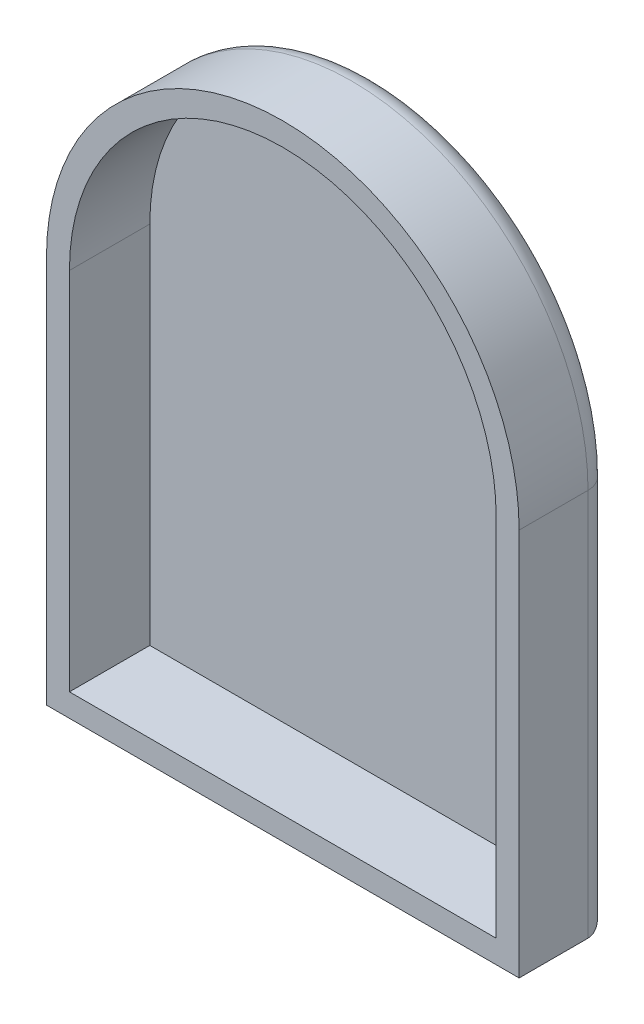
ISO-10303-21;
HEADER;
FILE_DESCRIPTION(('STEP AP214'),'2;1');
FILE_NAME('part.step','',(''),(''),'','','');
FILE_SCHEMA(('AUTOMOTIVE_DESIGN { 1 0 10303 214 1 1 1 1 }'));
ENDSEC;
DATA;
#1=APPLICATION_CONTEXT('core data for automotive mechanical design processes');
#2=APPLICATION_PROTOCOL_DEFINITION('international standard','automotive_design',2000,#1);
#3=PRODUCT_CONTEXT('',#1,'mechanical');
#4=PRODUCT('Part','Part','',(#3));
#5=PRODUCT_RELATED_PRODUCT_CATEGORY('part','',(#4));
#6=PRODUCT_DEFINITION_FORMATION('','',#4);
#7=PRODUCT_DEFINITION_CONTEXT('part definition',#1,'design');
#8=PRODUCT_DEFINITION('design','',#6,#7);
#9=PRODUCT_DEFINITION_SHAPE('','',#8);
#10=(LENGTH_UNIT() NAMED_UNIT(*) SI_UNIT(.MILLI.,.METRE.));
#11=(NAMED_UNIT(*) PLANE_ANGLE_UNIT() SI_UNIT($,.RADIAN.));
#12=(NAMED_UNIT(*) SI_UNIT($,.STERADIAN.) SOLID_ANGLE_UNIT());
#13=UNCERTAINTY_MEASURE_WITH_UNIT(LENGTH_MEASURE(1.E-05),#10,'distance_accuracy_value','');
#14=(GEOMETRIC_REPRESENTATION_CONTEXT(3) GLOBAL_UNCERTAINTY_ASSIGNED_CONTEXT((#13)) GLOBAL_UNIT_ASSIGNED_CONTEXT((#10,
#11,#12)) REPRESENTATION_CONTEXT('',''));
#15=CARTESIAN_POINT('',(0.,0.,0.));
#16=DIRECTION('',(0.,0.,1.));
#17=DIRECTION('',(1.,0.,0.));
#18=AXIS2_PLACEMENT_3D('',#15,#16,#17);
#19=CARTESIAN_POINT('',(-9.291,-3.3,0.5));
#20=DIRECTION('',(0.,-1.,0.));
#21=DIRECTION('',(-1.,0.,0.));
#22=AXIS2_PLACEMENT_3D('',#19,#20,#21);
#23=CYLINDRICAL_SURFACE('',#22,1.);
#24=DIRECTION('',(0.,1.,0.));
#25=VECTOR('',#24,1.);
#26=CARTESIAN_POINT('',(-10.291,-8.4455,0.5));
#27=LINE('',#26,#25);
#28=CARTESIAN_POINT('',(-10.291,-16.891,0.5));
#29=VERTEX_POINT('',#28);
#30=CARTESIAN_POINT('',(-10.291,0.,0.5));
#31=VERTEX_POINT('',#30);
#32=EDGE_CURVE('E221',#29,#31,#27,.T.);
#33=ORIENTED_EDGE('',*,*,#32,.T.);
#34=CARTESIAN_POINT('',(-9.291,0.,0.5));
#35=DIRECTION('',(0.,1.,0.));
#36=DIRECTION('',(1.,0.,0.));
#37=AXIS2_PLACEMENT_3D('',#34,#35,#36);
#38=CIRCLE('',#37,1.);
#39=CARTESIAN_POINT('',(-9.291,0.,-0.5));
#40=VERTEX_POINT('',#39);
#41=EDGE_CURVE('E41',#40,#31,#38,.T.);
#42=ORIENTED_EDGE('',*,*,#41,.F.);
#43=DIRECTION('',(0.,1.,0.));
#44=VECTOR('',#43,1.);
#45=CARTESIAN_POINT('',(-9.291,-7.9455,-0.5));
#46=LINE('',#45,#44);
#47=CARTESIAN_POINT('',(-9.291,-15.891,-0.5));
#48=VERTEX_POINT('',#47);
#49=EDGE_CURVE('E192',#48,#40,#46,.T.);
#50=ORIENTED_EDGE('',*,*,#49,.F.);
#51=CARTESIAN_POINT('',(-10.291,-16.891,0.5));
#52=CARTESIAN_POINT('',(-10.2910001524602,-16.8910001946307,0.490543666326398));
#53=CARTESIAN_POINT('',(-10.2908632958213,-16.8908658743145,0.481087437889396));
#54=CARTESIAN_POINT('',(-10.290317725518,-16.8903287676352,0.462160612143923));
#55=CARTESIAN_POINT('',(-10.2899081571138,-16.8899251371854,0.452690063360961));
#56=CARTESIAN_POINT('',(-10.2888172040033,-16.8888478600824,0.433742339953688));
#57=CARTESIAN_POINT('',(-10.2881347497725,-16.8881731509368,0.424265287491078));
#58=CARTESIAN_POINT('',(-10.2864982846785,-16.8865526702302,0.405312285531256));
#59=CARTESIAN_POINT('',(-10.2855429995691,-16.8856056265952,0.395836555013209));
#60=CARTESIAN_POINT('',(-10.2833610613804,-16.8834395687429,0.376894013547939));
#61=CARTESIAN_POINT('',(-10.2821329400308,-16.882219082679,0.367427540316734));
#62=CARTESIAN_POINT('',(-10.2794055229729,-16.8795054712031,0.348511384707197));
#63=CARTESIAN_POINT('',(-10.2779045774557,-16.8780106865099,0.339062178611405));
#64=CARTESIAN_POINT('',(-10.2746316883555,-16.8747480240665,0.320188486632994));
#65=CARTESIAN_POINT('',(-10.2728579269717,-16.8729783135978,0.310764633266375));
#66=CARTESIAN_POINT('',(-10.2690395696853,-16.869165570663,0.291949627776047));
#67=CARTESIAN_POINT('',(-10.2669930024615,-16.8671205475754,0.282559279679478));
#68=CARTESIAN_POINT('',(-10.2626291819506,-16.8627571759433,0.26381931365317));
#69=CARTESIAN_POINT('',(-10.2603098188949,-16.8604366955713,0.254470684062168));
#70=CARTESIAN_POINT('',(-10.2554005400758,-16.8555226346705,0.235822227159337));
#71=CARTESIAN_POINT('',(-10.2528083915155,-16.8529267986664,0.226523582776317));
#72=CARTESIAN_POINT('',(-10.2473536592159,-16.8474624835014,0.207983207294776));
#73=CARTESIAN_POINT('',(-10.2444887351551,-16.8445916433266,0.198742861497731));
#74=CARTESIAN_POINT('',(-10.2384885549629,-16.8385780109923,0.180327227043418));
#75=CARTESIAN_POINT('',(-10.2353508663613,-16.8354327706448,0.171153531406337));
#76=CARTESIAN_POINT('',(-10.2288052407585,-16.8288712686858,0.152879373238824));
#77=CARTESIAN_POINT('',(-10.2253947941147,-16.8254524900952,0.143780714531682));
#78=CARTESIAN_POINT('',(-10.2183037368924,-16.8183450764707,0.125664816171064));
#79=CARTESIAN_POINT('',(-10.2146205541691,-16.8146538737154,0.116649591894967));
#80=CARTESIAN_POINT('',(-10.2069840354605,-16.8070030465137,0.0987088158046046));
#81=CARTESIAN_POINT('',(-10.2030280779889,-16.8030408215736,0.0897854904109754));
#82=CARTESIAN_POINT('',(-10.1948462326687,-16.7948495338395,0.072036586668844));
#83=CARTESIAN_POINT('',(-10.1906176897101,-16.790617853682,0.0632134406901363));
#84=CARTESIAN_POINT('',(-10.182679399183,-16.7826792654125,0.0472600789362643));
#85=CARTESIAN_POINT('',(-10.1790033952477,-16.779005176991,0.0400966757971117));
#86=CARTESIAN_POINT('',(-10.1714506692589,-16.7714595462954,0.0258088224660671));
#87=CARTESIAN_POINT('',(-10.1675717154455,-16.7675858225376,0.0186867084863741));
#88=CARTESIAN_POINT('',(-10.1555404055222,-16.7555728475946,-0.00277913316464829));
#89=CARTESIAN_POINT('',(-10.1471657567992,-16.7472138156977,-0.0168769336126997));
#90=CARTESIAN_POINT('',(-10.1296225048111,-16.7296999575148,-0.0448516422476389));
#91=CARTESIAN_POINT('',(-10.1204371629781,-16.720528318797,-0.0587074414112945));
#92=CARTESIAN_POINT('',(-10.1012711514418,-16.7013823967746,-0.0861476220041017));
#93=CARTESIAN_POINT('',(-10.0912745051185,-16.6913918913324,-0.0997095029802508));
#94=CARTESIAN_POINT('',(-10.0704852489744,-16.6706053959014,-0.126507790749028));
#95=CARTESIAN_POINT('',(-10.0596774709961,-16.6597939308807,-0.139720384871261));
#96=CARTESIAN_POINT('',(-10.0372651713873,-16.6373657896549,-0.165764698577901));
#97=CARTESIAN_POINT('',(-10.025646287957,-16.6257344893989,-0.17857143073215));
#98=CARTESIAN_POINT('',(-10.0016107013408,-16.6016710948097,-0.203746544202589));
#99=CARTESIAN_POINT('',(-9.9891804212961,-16.5892253430506,-0.216088863612556));
#100=CARTESIAN_POINT('',(-9.9635223812782,-16.5635398637785,-0.240277515775999));
#101=CARTESIAN_POINT('',(-9.95028185064989,-16.5502874882351,-0.252096858410558));
#102=CARTESIAN_POINT('',(-9.92633516261139,-16.5263424745326,-0.272353186765918));
#103=CARTESIAN_POINT('',(-9.91570547451688,-16.5157213409678,-0.280965977094137));
#104=CARTESIAN_POINT('',(-9.89377924240583,-16.4938208891221,-0.298002167160245));
#105=CARTESIAN_POINT('',(-9.88247347339899,-16.4825326960761,-0.306402290222646));
#106=CARTESIAN_POINT('',(-9.85919564459653,-16.4592874385385,-0.322958804959713));
#107=CARTESIAN_POINT('',(-9.84721518844278,-16.4473218436399,-0.33109138476631));
#108=CARTESIAN_POINT('',(-9.82258688649055,-16.4227149608419,-0.347055280761626));
#109=CARTESIAN_POINT('',(-9.80993131286282,-16.4100655959458,-0.354862207273603));
#110=CARTESIAN_POINT('',(-9.78395213473499,-16.3840880002658,-0.370114723947644));
#111=CARTESIAN_POINT('',(-9.77062141306368,-16.3707522318706,-0.377535331740678));
#112=CARTESIAN_POINT('',(-9.74329174226356,-16.343402265217,-0.391952815161348));
#113=CARTESIAN_POINT('',(-9.72928623590774,-16.3293811417304,-0.398924108588746));
#114=CARTESIAN_POINT('',(-9.70060484994935,-16.3006674552877,-0.412377602863759));
#115=CARTESIAN_POINT('',(-9.6859228438176,-16.2859687476359,-0.418833590871486));
#116=CARTESIAN_POINT('',(-9.65589442425351,-16.2559036240454,-0.431191886963874));
#117=CARTESIAN_POINT('',(-9.64054254897521,-16.2405316523486,-0.437067452052893));
#118=CARTESIAN_POINT('',(-9.61556113989849,-16.2155687962718,-0.445916235212109));
#119=CARTESIAN_POINT('',(-9.60598546940986,-16.2060122697991,-0.449140871987699));
#120=CARTESIAN_POINT('',(-9.58559705791396,-16.1856844631445,-0.455661327982759));
#121=CARTESIAN_POINT('',(-9.5747766987321,-16.1749080149349,-0.458917329639943));
#122=CARTESIAN_POINT('',(-9.55190149310928,-16.1521160440174,-0.465387810968759));
#123=CARTESIAN_POINT('',(-9.53984100631433,-16.1400938546898,-0.468558838650311));
#124=CARTESIAN_POINT('',(-9.51448298695673,-16.1147952336725,-0.474731517278914));
#125=CARTESIAN_POINT('',(-9.50118069308199,-16.1015119736315,-0.477685667053249));
#126=CARTESIAN_POINT('',(-9.47333860368919,-16.0736815373039,-0.483283569236416));
#127=CARTESIAN_POINT('',(-9.45879487325773,-16.0591279025922,-0.485875682202742));
#128=CARTESIAN_POINT('',(-9.42846906878814,-16.0287571341147,-0.490594864493285));
#129=CARTESIAN_POINT('',(-9.41268364722985,-16.0129346484143,-0.492666057890532));
#130=CARTESIAN_POINT('',(-9.37987409721194,-15.9800387668406,-0.496175736422245));
#131=CARTESIAN_POINT('',(-9.36284710886982,-15.9629617971239,-0.497554086684956));
#132=CARTESIAN_POINT('',(-9.32755346427752,-15.9275855087842,-0.499498481298503));
#133=CARTESIAN_POINT('',(-9.30928428859014,-15.9092851453396,-0.500000192282705));
#134=CARTESIAN_POINT('',(-9.291,-15.891,-0.5));
#135=B_SPLINE_CURVE_WITH_KNOTS('',3,(#51,#52,#53,#54,#55,#56,#57,#58,#59,#60,#61,#62,#63,#64,
#65,#66,#67,#68,#69,#70,#71,#72,#73,#74,#75,#76,#77,#78,#79,#80,#81,#82,#83,#84,#85,#86,#87,#88,
#89,#90,#91,#92,#93,#94,#95,#96,#97,#98,#99,#100,#101,#102,#103,#104,#105,#106,#107,#108,#109,
#110,#111,#112,#113,#114,#115,#116,#117,#118,#119,#120,#121,#122,#123,#124,#125,#126,#127,#128,
#129,#130,#131,#132,#133,#134),.UNSPECIFIED.,.F.,.F.,(4,2,2,2,2,2,2,2,2,2,2,2,2,2,2,2,2,2,2,2,2,
2,2,2,2,2,2,2,2,2,2,2,2,2,2,2,2,2,2,2,2,4),(0.,0.0283669000185543,0.0568231294289983,
0.0853919983375216,0.114096542437789,0.142959472575231,0.172003128044889,0.201249434012512,
0.230719863348328,0.260435403062094,0.29041652543042,0.32068316381616,0.351254693097338,
0.382149914551442,0.413387044981128,0.444983709819722,0.476956939919375,0.503503990136625,
0.530463681131045,0.585648876350322,0.642580469800979,0.701315455445699,0.761905738139045,
0.824398599769967,0.888837134045676,0.955260647636834,1.00720958642691,1.06134772947503,
1.11768796853035,1.17624173962811,1.23701922808876,1.30002953967565,1.36528084419801,
1.4327804965703,1.47449988208435,1.5213384567052,1.57329747272263,1.63037781824186,
1.69258013460214,1.75990488916631,1.83235242239411,1.90992297938009),.UNSPECIFIED.);
#136=EDGE_CURVE('E28',#29,#48,#135,.T.);
#137=ORIENTED_EDGE('',*,*,#136,.F.);
#138=EDGE_LOOP('',(#33,#42,#50,#137));
#139=FACE_BOUND('',#138,.T.);
#140=ADVANCED_FACE('F17',(#139),#23,.T.);
#141=CARTESIAN_POINT('',(9.291,-3.3,0.5));
#142=DIRECTION('',(0.,1.,0.));
#143=DIRECTION('',(1.,0.,0.));
#144=AXIS2_PLACEMENT_3D('',#141,#142,#143);
#145=CYLINDRICAL_SURFACE('',#144,1.);
#146=DIRECTION('',(0.,-1.,0.));
#147=VECTOR('',#146,1.);
#148=CARTESIAN_POINT('',(9.291,-7.9455,-0.5));
#149=LINE('',#148,#147);
#150=CARTESIAN_POINT('',(9.291,0.,-0.5));
#151=VERTEX_POINT('',#150);
#152=CARTESIAN_POINT('',(9.291,-15.891,-0.5));
#153=VERTEX_POINT('',#152);
#154=EDGE_CURVE('E220',#151,#153,#149,.T.);
#155=ORIENTED_EDGE('',*,*,#154,.F.);
#156=CARTESIAN_POINT('',(9.291,0.,0.5));
#157=DIRECTION('',(0.,-1.,0.));
#158=DIRECTION('',(1.,0.,0.));
#159=AXIS2_PLACEMENT_3D('',#156,#157,#158);
#160=CIRCLE('',#159,1.);
#161=CARTESIAN_POINT('',(10.291,0.,0.5));
#162=VERTEX_POINT('',#161);
#163=EDGE_CURVE('E58',#151,#162,#160,.T.);
#164=ORIENTED_EDGE('',*,*,#163,.T.);
#165=DIRECTION('',(0.,-1.,0.));
#166=VECTOR('',#165,1.);
#167=CARTESIAN_POINT('',(10.291,-8.4455,0.5));
#168=LINE('',#167,#166);
#169=CARTESIAN_POINT('',(10.291,-16.891,0.5));
#170=VERTEX_POINT('',#169);
#171=EDGE_CURVE('E137',#162,#170,#168,.T.);
#172=ORIENTED_EDGE('',*,*,#171,.T.);
#173=CARTESIAN_POINT('',(10.291,-16.891,0.5));
#174=CARTESIAN_POINT('',(10.2910001946311,-16.8910001524608,0.490543655385902));
#175=CARTESIAN_POINT('',(10.2908658740041,-16.8908632958385,0.481087416004436));
#176=CARTESIAN_POINT('',(10.290328766124,-16.8903177255172,0.462160569861163));
#177=CARTESIAN_POINT('',(10.289925134825,-16.8899081571211,0.452690011622477));
#178=CARTESIAN_POINT('',(10.2888478555678,-16.8888172039751,0.433742270812779));
#179=CARTESIAN_POINT('',(10.288173145158,-16.8881347497431,0.424265210398697));
#180=CARTESIAN_POINT('',(10.2865526615929,-16.8864982845955,0.405312194058761));
#181=CARTESIAN_POINT('',(10.2856056164041,-16.8855429994754,0.395836457105018));
#182=CARTESIAN_POINT('',(10.28343955524,-16.8833610612151,0.376893904297024));
#183=CARTESIAN_POINT('',(10.2822190674583,-16.8821329398452,0.367427426149555));
#184=CARTESIAN_POINT('',(10.2795054524695,-16.8794055226975,0.348511262234938));
#185=CARTESIAN_POINT('',(10.2780106660206,-16.8779045771503,0.339062052739061));
#186=CARTESIAN_POINT('',(10.2747480001152,-16.8746316879421,0.320188355479285));
#187=CARTESIAN_POINT('',(10.2729782879791,-16.8728579265183,0.31076450021825));
#188=CARTESIAN_POINT('',(10.2691655418853,-16.8690395691057,0.291949492441841));
#189=CARTESIAN_POINT('',(10.2671205173443,-16.8669930018318,0.282559143938785));
#190=CARTESIAN_POINT('',(10.262757143107,-16.8626291811763,0.263819178578766));
#191=CARTESIAN_POINT('',(10.2604366616205,-16.8603098180602,0.25447055004423));
#192=CARTESIAN_POINT('',(10.2555225989172,-16.8554005390784,0.235822096702465));
#193=CARTESIAN_POINT('',(10.2529267622616,-16.8528083904478,0.226523454806438));
#194=CARTESIAN_POINT('',(10.2474624463434,-16.8473536579664,0.207983085709025));
#195=CARTESIAN_POINT('',(10.2445916061027,-16.844488733824,0.198742743790407));
#196=CARTESIAN_POINT('',(10.2385779743071,-16.8384885534344,0.180327118455337));
#197=CARTESIAN_POINT('',(10.2354327345991,-16.8353508647445,0.171153428039421));
#198=CARTESIAN_POINT('',(10.2288712347125,-16.8288052389159,0.152879281630246));
#199=CARTESIAN_POINT('',(10.2254524575887,-16.8253947921598,0.143780629439937));
#200=CARTESIAN_POINT('',(10.218345047795,-16.8183037347312,0.125664745342055));
#201=CARTESIAN_POINT('',(10.2146538474367,-16.8146205519377,0.116649528790612));
#202=CARTESIAN_POINT('',(10.2070030260897,-16.8069840328609,0.0987087694105727));
#203=CARTESIAN_POINT('',(10.2030408046401,-16.8030280751101,0.0897854529820071));
#204=CARTESIAN_POINT('',(10.1948495248687,-16.7948462299484,0.0720365679771261));
#205=CARTESIAN_POINT('',(10.1906178492132,-16.7906176874552,0.0632134317451248));
#206=CARTESIAN_POINT('',(10.1826793166632,-16.7826794410556,0.0472601819000966));
#207=CARTESIAN_POINT('',(10.1790052811301,-16.7790034832193,0.0400968788526684));
#208=CARTESIAN_POINT('',(10.1714597543606,-16.7714508420718,0.0258092104863574));
#209=CARTESIAN_POINT('',(10.1675860814291,-16.7675719266992,0.0186871816520877));
#210=CARTESIAN_POINT('',(10.1555732440436,-16.7555407113037,-0.00277844635705663));
#211=CARTESIAN_POINT('',(10.1472143036629,-16.7471661179314,-0.0168761204392693));
#212=CARTESIAN_POINT('',(10.129700610006,-16.729622950373,-0.0448506348540514));
#213=CARTESIAN_POINT('',(10.1205290426073,-16.7204376357294,-0.0587063639116655));
#214=CARTESIAN_POINT('',(10.1013832371957,-16.701271652181,-0.0861464588929335));
#215=CARTESIAN_POINT('',(10.0913927753587,-16.6912750050315,-0.0997083220628799));
#216=CARTESIAN_POINT('',(10.0706063339065,-16.6704857205133,-0.126506623974619));
#217=CARTESIAN_POINT('',(10.0597948775843,-16.659677913595,-0.139719247688814));
#218=CARTESIAN_POINT('',(10.0373667135451,-16.6372655293278,-0.165763664747842));
#219=CARTESIAN_POINT('',(10.0257353801127,-16.6256465889996,-0.178570468249949));
#220=CARTESIAN_POINT('',(10.0016718728702,-16.6016108610025,-0.203745761767799));
#221=CARTESIAN_POINT('',(9.98922604000298,-16.5891804954559,-0.216088187388186));
#222=CARTESIAN_POINT('',(9.96354034493604,-16.5635222590612,-0.24027708315333));
#223=CARTESIAN_POINT('',(9.95028783305893,-16.5502816167723,-0.252096560653131));
#224=CARTESIAN_POINT('',(9.92634259093639,-16.5263347599392,-0.27235309302895));
#225=CARTESIAN_POINT('',(9.91572136888487,-16.5157050149412,-0.280965956704918));
#226=CARTESIAN_POINT('',(9.89382075967725,-16.4937786866508,-0.298002266471304));
#227=CARTESIAN_POINT('',(9.88253249816873,-16.4824728786603,-0.306402436823556));
#228=CARTESIAN_POINT('',(9.85928712465952,-16.459194991504,-0.32295902265104));
#229=CARTESIAN_POINT('',(9.84732148266552,-16.4472145162816,-0.331091627275691));
#230=CARTESIAN_POINT('',(9.82271452932411,-16.4225861953088,-0.34705555206027));
#231=CARTESIAN_POINT('',(9.81006514144312,-16.4099306219516,-0.354862483600715));
#232=CARTESIAN_POINT('',(9.78408752550911,-16.3839514637591,-0.370114992866772));
#233=CARTESIAN_POINT('',(9.77075176032526,-16.370620761938,-0.377535589345009));
#234=CARTESIAN_POINT('',(9.74340182812588,-16.3432911499426,-0.39195303621236));
#235=CARTESIAN_POINT('',(9.72938073638436,-16.3292856826761,-0.398924305586939));
#236=CARTESIAN_POINT('',(9.70066714220684,-16.3006043951861,-0.412377742222542));
#237=CARTESIAN_POINT('',(9.68596849553434,-16.2859224485818,-0.418833697918701));
#238=CARTESIAN_POINT('',(9.65590352820816,-16.2558941638904,-0.431191922821951));
#239=CARTESIAN_POINT('',(9.64053165239087,-16.2405423639134,-0.437067450335787));
#240=CARTESIAN_POINT('',(9.61556847897065,-16.2155606156529,-0.445916348741125));
#241=CARTESIAN_POINT('',(9.60601153877666,-16.2059845244881,-0.449141119239143));
#242=CARTESIAN_POINT('',(9.58568301351283,-16.1855953932566,-0.455661778639521));
#243=CARTESIAN_POINT('',(9.5749062599174,-16.1747747365035,-0.458917852901059));
#244=CARTESIAN_POINT('',(9.55211379253456,-16.1518990553662,-0.465388422393201));
#245=CARTESIAN_POINT('',(9.54009141252736,-16.1398383913161,-0.468559469149501));
#246=CARTESIAN_POINT('',(9.51479252741578,-16.1144801382033,-0.47473213953388));
#247=CARTESIAN_POINT('',(9.50150919459081,-16.1011777883894,-0.477686266331684));
#248=CARTESIAN_POINT('',(9.47367873384396,-16.0733357077989,-0.483284089219611));
#249=CARTESIAN_POINT('',(9.459125148324,-16.0587920424753,-0.485876151038331));
#250=CARTESIAN_POINT('',(9.42875460234809,-16.0284664891202,-0.490595213658942));
#251=CARTESIAN_POINT('',(9.41293229078628,-16.0126812538362,-0.492666344578438));
#252=CARTESIAN_POINT('',(9.38003688349558,-15.9798721973133,-0.496175899531584));
#253=CARTESIAN_POINT('',(9.36296021461077,-15.9628455163795,-0.497554195625928));
#254=CARTESIAN_POINT('',(9.32758465384764,-15.9275526076875,-0.49949850476593));
#255=CARTESIAN_POINT('',(9.30928471752161,-15.9092838606352,-0.500000192265199));
#256=CARTESIAN_POINT('',(9.291,-15.891,-0.5));
#257=B_SPLINE_CURVE_WITH_KNOTS('',3,(#173,#174,#175,#176,#177,#178,#179,#180,#181,#182,#183,
#184,#185,#186,#187,#188,#189,#190,#191,#192,#193,#194,#195,#196,#197,#198,#199,#200,#201,#202,
#203,#204,#205,#206,#207,#208,#209,#210,#211,#212,#213,#214,#215,#216,#217,#218,#219,#220,#221,
#222,#223,#224,#225,#226,#227,#228,#229,#230,#231,#232,#233,#234,#235,#236,#237,#238,#239,#240,
#241,#242,#243,#244,#245,#246,#247,#248,#249,#250,#251,#252,#253,#254,#255,#256),.UNSPECIFIED.,
.F.,.F.,(4,2,2,2,2,2,2,2,2,2,2,2,2,2,2,2,2,2,2,2,2,2,2,2,2,2,2,2,2,2,2,2,2,2,2,2,2,2,2,2,2,4),
(0.,0.0283669328437804,0.0568231906680508,0.0853920835683221,0.114096647238665,
0.142959592535672,0.172003258775841,0.201249571156136,0.230720002587107,0.26043554012725,
0.290416656109571,0.320683283960196,0.351254798626497,0.382150001460587,0.413387109344237,
0.444983747793618,0.476956947746725,0.503503631688773,0.53046300480949,0.58564770993384,
0.642579007478214,0.70131389098451,0.761904264384743,0.824397408267674,0.888836414764405,
0.955260588775721,1.00720990429012,1.06134831478066,1.11768871237775,1.17624253352827,
1.23701996397971,1.30003010992705,1.36528114160827,1.43278041435855,1.4745016142862,
1.52134148488605,1.5733012783592,1.63038188278981,1.69258393953083,1.75990791597717,
1.83235415263054,1.90992289463297),.UNSPECIFIED.);
#258=EDGE_CURVE('E11',#170,#153,#257,.T.);
#259=ORIENTED_EDGE('',*,*,#258,.T.);
#260=EDGE_LOOP('',(#155,#164,#172,#259));
#261=FACE_BOUND('',#260,.T.);
#262=ADVANCED_FACE('F232',(#261),#145,.T.);
#263=CARTESIAN_POINT('',(0.,-15.891,0.5));
#264=DIRECTION('',(1.,0.,0.));
#265=DIRECTION('',(0.,-1.,0.));
#266=AXIS2_PLACEMENT_3D('',#263,#264,#265);
#267=CYLINDRICAL_SURFACE('',#266,1.);
#268=ORIENTED_EDGE('',*,*,#136,.T.);
#269=DIRECTION('',(-1.,0.,0.));
#270=VECTOR('',#269,1.);
#271=CARTESIAN_POINT('',(0.,-15.891,-0.5));
#272=LINE('',#271,#270);
#273=EDGE_CURVE('E303',#153,#48,#272,.T.);
#274=ORIENTED_EDGE('',*,*,#273,.F.);
#275=ORIENTED_EDGE('',*,*,#258,.F.);
#276=DIRECTION('',(-1.,0.,0.));
#277=VECTOR('',#276,1.);
#278=CARTESIAN_POINT('',(0.,-16.891,0.5));
#279=LINE('',#278,#277);
#280=EDGE_CURVE('E299',#170,#29,#279,.T.);
#281=ORIENTED_EDGE('',*,*,#280,.T.);
#282=EDGE_LOOP('',(#268,#274,#275,#281));
#283=FACE_BOUND('',#282,.T.);
#284=ADVANCED_FACE('F241',(#283),#267,.T.);
#285=CARTESIAN_POINT('',(0.,0.,0.5));
#286=DIRECTION('',(0.,0.,-1.));
#287=DIRECTION('',(-1.,0.,0.));
#288=AXIS2_PLACEMENT_3D('',#285,#286,#287);
#289=TOROIDAL_SURFACE('',#288,9.291,1.);
#290=ORIENTED_EDGE('',*,*,#41,.T.);
#291=CARTESIAN_POINT('',(0.,0.,0.5));
#292=DIRECTION('',(0.,0.,-1.));
#293=DIRECTION('',(1.,0.,0.));
#294=AXIS2_PLACEMENT_3D('',#291,#292,#293);
#295=CIRCLE('',#294,10.291);
#296=EDGE_CURVE('E217',#31,#162,#295,.T.);
#297=ORIENTED_EDGE('',*,*,#296,.T.);
#298=ORIENTED_EDGE('',*,*,#163,.F.);
#299=CARTESIAN_POINT('',(0.,0.,-0.5));
#300=DIRECTION('',(0.,0.,-1.));
#301=DIRECTION('',(1.,0.,0.));
#302=AXIS2_PLACEMENT_3D('',#299,#300,#301);
#303=CIRCLE('',#302,9.291);
#304=EDGE_CURVE('E189',#40,#151,#303,.T.);
#305=ORIENTED_EDGE('',*,*,#304,.F.);
#306=EDGE_LOOP('',(#290,#297,#298,#305));
#307=FACE_BOUND('',#306,.T.);
#308=ADVANCED_FACE('F19',(#307),#289,.T.);
#309=CARTESIAN_POINT('',(0.,0.,-0.5));
#310=DIRECTION('',(0.,0.,-1.));
#311=DIRECTION('',(0.,-1.,0.));
#312=AXIS2_PLACEMENT_3D('',#309,#310,#311);
#313=PLANE('',#312);
#314=ORIENTED_EDGE('',*,*,#154,.T.);
#315=ORIENTED_EDGE('',*,*,#273,.T.);
#316=ORIENTED_EDGE('',*,*,#49,.T.);
#317=ORIENTED_EDGE('',*,*,#304,.T.);
#318=EDGE_LOOP('',(#314,#315,#316,#317));
#319=FACE_BOUND('',#318,.T.);
#320=ADVANCED_FACE('F245',(#319),#313,.T.);
#321=CARTESIAN_POINT('',(0.,0.,-0.25));
#322=DIRECTION('',(0.,0.,-1.));
#323=DIRECTION('',(-1.,0.,0.));
#324=AXIS2_PLACEMENT_3D('',#321,#322,#323);
#325=CYLINDRICAL_SURFACE('',#324,10.291);
#326=DIRECTION('',(0.,0.,1.));
#327=VECTOR('',#326,1.);
#328=CARTESIAN_POINT('',(-10.291,0.,2.));
#329=LINE('',#328,#327);
#330=CARTESIAN_POINT('',(-10.291,0.,3.5));
#331=VERTEX_POINT('',#330);
#332=EDGE_CURVE('E142',#31,#331,#329,.T.);
#333=ORIENTED_EDGE('',*,*,#332,.T.);
#334=CARTESIAN_POINT('',(0.,0.,3.5));
#335=DIRECTION('',(0.,0.,1.));
#336=DIRECTION('',(1.,0.,0.));
#337=AXIS2_PLACEMENT_3D('',#334,#335,#336);
#338=CIRCLE('',#337,10.291);
#339=CARTESIAN_POINT('',(10.291,0.,3.5));
#340=VERTEX_POINT('',#339);
#341=EDGE_CURVE('E148',#340,#331,#338,.T.);
#342=ORIENTED_EDGE('',*,*,#341,.F.);
#343=DIRECTION('',(0.,0.,1.));
#344=VECTOR('',#343,1.);
#345=CARTESIAN_POINT('',(10.291,0.,2.));
#346=LINE('',#345,#344);
#347=EDGE_CURVE('E131',#162,#340,#346,.T.);
#348=ORIENTED_EDGE('',*,*,#347,.F.);
#349=ORIENTED_EDGE('',*,*,#296,.F.);
#350=EDGE_LOOP('',(#333,#342,#348,#349));
#351=FACE_BOUND('',#350,.T.);
#352=ADVANCED_FACE('F154',(#351),#325,.T.);
#353=CARTESIAN_POINT('',(-10.291,0.,0.));
#354=DIRECTION('',(-1.,0.,0.));
#355=DIRECTION('',(0.,0.,1.));
#356=AXIS2_PLACEMENT_3D('',#353,#354,#355);
#357=PLANE('',#356);
#358=DIRECTION('',(0.,0.,1.));
#359=VECTOR('',#358,1.);
#360=CARTESIAN_POINT('',(-10.291,-16.891,2.));
#361=LINE('',#360,#359);
#362=CARTESIAN_POINT('',(-10.291,-16.891,3.5));
#363=VERTEX_POINT('',#362);
#364=EDGE_CURVE('E296',#29,#363,#361,.T.);
#365=ORIENTED_EDGE('',*,*,#364,.T.);
#366=DIRECTION('',(0.,-1.,0.));
#367=VECTOR('',#366,1.);
#368=CARTESIAN_POINT('',(-10.291,-8.4455,3.5));
#369=LINE('',#368,#367);
#370=EDGE_CURVE('E158',#331,#363,#369,.T.);
#371=ORIENTED_EDGE('',*,*,#370,.F.);
#372=ORIENTED_EDGE('',*,*,#332,.F.);
#373=ORIENTED_EDGE('',*,*,#32,.F.);
#374=EDGE_LOOP('',(#365,#371,#372,#373));
#375=FACE_BOUND('',#374,.T.);
#376=ADVANCED_FACE('F244',(#375),#357,.T.);
#377=CARTESIAN_POINT('',(10.291,0.,0.));
#378=DIRECTION('',(-1.,0.,0.));
#379=DIRECTION('',(0.,0.,1.));
#380=AXIS2_PLACEMENT_3D('',#377,#378,#379);
#381=PLANE('',#380);
#382=ORIENTED_EDGE('',*,*,#171,.F.);
#383=ORIENTED_EDGE('',*,*,#347,.T.);
#384=DIRECTION('',(0.,1.,0.));
#385=VECTOR('',#384,1.);
#386=CARTESIAN_POINT('',(10.291,-8.4455,3.5));
#387=LINE('',#386,#385);
#388=CARTESIAN_POINT('',(10.291,-16.891,3.5));
#389=VERTEX_POINT('',#388);
#390=EDGE_CURVE('E135',#389,#340,#387,.T.);
#391=ORIENTED_EDGE('',*,*,#390,.F.);
#392=DIRECTION('',(0.,0.,1.));
#393=VECTOR('',#392,1.);
#394=CARTESIAN_POINT('',(10.291,-16.891,2.));
#395=LINE('',#394,#393);
#396=EDGE_CURVE('E152',#170,#389,#395,.T.);
#397=ORIENTED_EDGE('',*,*,#396,.F.);
#398=EDGE_LOOP('',(#382,#383,#391,#397));
#399=FACE_BOUND('',#398,.T.);
#400=ADVANCED_FACE('F133',(#399),#381,.F.);
#401=CARTESIAN_POINT('',(-10.291,-16.891,0.));
#402=DIRECTION('',(0.,-1.,0.));
#403=DIRECTION('',(0.,0.,-1.));
#404=AXIS2_PLACEMENT_3D('',#401,#402,#403);
#405=PLANE('',#404);
#406=ORIENTED_EDGE('',*,*,#396,.T.);
#407=DIRECTION('',(1.,0.,0.));
#408=VECTOR('',#407,1.);
#409=CARTESIAN_POINT('',(0.,-16.891,3.5));
#410=LINE('',#409,#408);
#411=EDGE_CURVE('E150',#363,#389,#410,.T.);
#412=ORIENTED_EDGE('',*,*,#411,.F.);
#413=ORIENTED_EDGE('',*,*,#364,.F.);
#414=ORIENTED_EDGE('',*,*,#280,.F.);
#415=EDGE_LOOP('',(#406,#412,#413,#414));
#416=FACE_BOUND('',#415,.T.);
#417=ADVANCED_FACE('F257',(#416),#405,.T.);
#418=CARTESIAN_POINT('',(0.,0.,3.5));
#419=DIRECTION('',(0.,0.,1.));
#420=DIRECTION('',(1.,0.,0.));
#421=AXIS2_PLACEMENT_3D('',#418,#419,#420);
#422=PLANE('',#421);
#423=DIRECTION('',(0.,1.,0.));
#424=VECTOR('',#423,1.);
#425=CARTESIAN_POINT('',(9.291,-7.9455,3.5));
#426=LINE('',#425,#424);
#427=CARTESIAN_POINT('',(9.291,-15.891,3.5));
#428=VERTEX_POINT('',#427);
#429=CARTESIAN_POINT('',(9.291,0.,3.5));
#430=VERTEX_POINT('',#429);
#431=EDGE_CURVE('E194',#428,#430,#426,.T.);
#432=ORIENTED_EDGE('',*,*,#431,.F.);
#433=DIRECTION('',(1.,0.,0.));
#434=VECTOR('',#433,1.);
#435=CARTESIAN_POINT('',(0.,-15.891,3.5));
#436=LINE('',#435,#434);
#437=CARTESIAN_POINT('',(-9.291,-15.891,3.5));
#438=VERTEX_POINT('',#437);
#439=EDGE_CURVE('E186',#438,#428,#436,.T.);
#440=ORIENTED_EDGE('',*,*,#439,.F.);
#441=DIRECTION('',(0.,-1.,0.));
#442=VECTOR('',#441,1.);
#443=CARTESIAN_POINT('',(-9.291,-7.9455,3.5));
#444=LINE('',#443,#442);
#445=CARTESIAN_POINT('',(-9.291,0.,3.5));
#446=VERTEX_POINT('',#445);
#447=EDGE_CURVE('E172',#446,#438,#444,.T.);
#448=ORIENTED_EDGE('',*,*,#447,.F.);
#449=CARTESIAN_POINT('',(0.,0.,3.5));
#450=DIRECTION('',(0.,0.,1.));
#451=DIRECTION('',(1.,0.,0.));
#452=AXIS2_PLACEMENT_3D('',#449,#450,#451);
#453=CIRCLE('',#452,9.291);
#454=EDGE_CURVE('E159',#430,#446,#453,.T.);
#455=ORIENTED_EDGE('',*,*,#454,.F.);
#456=EDGE_LOOP('',(#432,#440,#448,#455));
#457=FACE_BOUND('',#456,.T.);
#458=ORIENTED_EDGE('',*,*,#341,.T.);
#459=ORIENTED_EDGE('',*,*,#370,.T.);
#460=ORIENTED_EDGE('',*,*,#411,.T.);
#461=ORIENTED_EDGE('',*,*,#390,.T.);
#462=EDGE_LOOP('',(#458,#459,#460,#461));
#463=FACE_BOUND('',#462,.T.);
#464=ADVANCED_FACE('F146',(#457,#463),#422,.T.);
#465=CARTESIAN_POINT('',(0.,0.,1.75));
#466=DIRECTION('',(0.,0.,1.));
#467=DIRECTION('',(1.,0.,0.));
#468=AXIS2_PLACEMENT_3D('',#465,#466,#467);
#469=CYLINDRICAL_SURFACE('',#468,9.291);
#470=ORIENTED_EDGE('',*,*,#454,.T.);
#471=DIRECTION('',(0.,0.,1.));
#472=VECTOR('',#471,1.);
#473=CARTESIAN_POINT('',(-9.291,0.,1.75));
#474=LINE('',#473,#472);
#475=CARTESIAN_POINT('',(-9.291,0.,0.));
#476=VERTEX_POINT('',#475);
#477=EDGE_CURVE('E167',#476,#446,#474,.T.);
#478=ORIENTED_EDGE('',*,*,#477,.F.);
#479=CARTESIAN_POINT('',(0.,0.,0.));
#480=DIRECTION('',(0.,0.,1.));
#481=DIRECTION('',(1.,0.,0.));
#482=AXIS2_PLACEMENT_3D('',#479,#480,#481);
#483=CIRCLE('',#482,9.291);
#484=CARTESIAN_POINT('',(9.291,0.,0.));
#485=VERTEX_POINT('',#484);
#486=EDGE_CURVE('E180',#485,#476,#483,.T.);
#487=ORIENTED_EDGE('',*,*,#486,.F.);
#488=DIRECTION('',(0.,0.,1.));
#489=VECTOR('',#488,1.);
#490=CARTESIAN_POINT('',(9.291,0.,1.75));
#491=LINE('',#490,#489);
#492=EDGE_CURVE('E171',#485,#430,#491,.T.);
#493=ORIENTED_EDGE('',*,*,#492,.T.);
#494=EDGE_LOOP('',(#470,#478,#487,#493));
#495=FACE_BOUND('',#494,.T.);
#496=ADVANCED_FACE('F250',(#495),#469,.F.);
#497=CARTESIAN_POINT('',(-9.291,0.,0.));
#498=DIRECTION('',(-1.,0.,0.));
#499=DIRECTION('',(0.,0.,1.));
#500=AXIS2_PLACEMENT_3D('',#497,#498,#499);
#501=PLANE('',#500);
#502=ORIENTED_EDGE('',*,*,#447,.T.);
#503=DIRECTION('',(0.,0.,1.));
#504=VECTOR('',#503,1.);
#505=CARTESIAN_POINT('',(-9.291,-15.891,1.75));
#506=LINE('',#505,#504);
#507=CARTESIAN_POINT('',(-9.291,-15.891,0.));
#508=VERTEX_POINT('',#507);
#509=EDGE_CURVE('E174',#508,#438,#506,.T.);
#510=ORIENTED_EDGE('',*,*,#509,.F.);
#511=DIRECTION('',(0.,-1.,0.));
#512=VECTOR('',#511,1.);
#513=CARTESIAN_POINT('',(-9.291,-7.9455,0.));
#514=LINE('',#513,#512);
#515=EDGE_CURVE('E198',#476,#508,#514,.T.);
#516=ORIENTED_EDGE('',*,*,#515,.F.);
#517=ORIENTED_EDGE('',*,*,#477,.T.);
#518=EDGE_LOOP('',(#502,#510,#516,#517));
#519=FACE_BOUND('',#518,.T.);
#520=ADVANCED_FACE('F246',(#519),#501,.F.);
#521=CARTESIAN_POINT('',(9.291,-15.891,0.));
#522=DIRECTION('',(0.,1.,0.));
#523=DIRECTION('',(1.,0.,0.));
#524=AXIS2_PLACEMENT_3D('',#521,#522,#523);
#525=PLANE('',#524);
#526=ORIENTED_EDGE('',*,*,#439,.T.);
#527=DIRECTION('',(0.,0.,1.));
#528=VECTOR('',#527,1.);
#529=CARTESIAN_POINT('',(9.291,-15.891,1.75));
#530=LINE('',#529,#528);
#531=CARTESIAN_POINT('',(9.291,-15.891,0.));
#532=VERTEX_POINT('',#531);
#533=EDGE_CURVE('E182',#532,#428,#530,.T.);
#534=ORIENTED_EDGE('',*,*,#533,.F.);
#535=DIRECTION('',(1.,0.,0.));
#536=VECTOR('',#535,1.);
#537=CARTESIAN_POINT('',(0.,-15.891,0.));
#538=LINE('',#537,#536);
#539=EDGE_CURVE('E181',#508,#532,#538,.T.);
#540=ORIENTED_EDGE('',*,*,#539,.F.);
#541=ORIENTED_EDGE('',*,*,#509,.T.);
#542=EDGE_LOOP('',(#526,#534,#540,#541));
#543=FACE_BOUND('',#542,.T.);
#544=ADVANCED_FACE('F249',(#543),#525,.T.);
#545=CARTESIAN_POINT('',(9.291,0.,0.));
#546=DIRECTION('',(-1.,0.,0.));
#547=DIRECTION('',(0.,0.,1.));
#548=AXIS2_PLACEMENT_3D('',#545,#546,#547);
#549=PLANE('',#548);
#550=ORIENTED_EDGE('',*,*,#431,.T.);
#551=ORIENTED_EDGE('',*,*,#492,.F.);
#552=DIRECTION('',(0.,1.,0.));
#553=VECTOR('',#552,1.);
#554=CARTESIAN_POINT('',(9.291,-7.9455,0.));
#555=LINE('',#554,#553);
#556=EDGE_CURVE('E176',#532,#485,#555,.T.);
#557=ORIENTED_EDGE('',*,*,#556,.F.);
#558=ORIENTED_EDGE('',*,*,#533,.T.);
#559=EDGE_LOOP('',(#550,#551,#557,#558));
#560=FACE_BOUND('',#559,.T.);
#561=ADVANCED_FACE('F259',(#560),#549,.T.);
#562=CARTESIAN_POINT('',(0.,0.,0.));
#563=DIRECTION('',(0.,0.,1.));
#564=DIRECTION('',(1.,0.,0.));
#565=AXIS2_PLACEMENT_3D('',#562,#563,#564);
#566=PLANE('',#565);
#567=ORIENTED_EDGE('',*,*,#539,.T.);
#568=ORIENTED_EDGE('',*,*,#556,.T.);
#569=ORIENTED_EDGE('',*,*,#486,.T.);
#570=ORIENTED_EDGE('',*,*,#515,.T.);
#571=EDGE_LOOP('',(#567,#568,#569,#570));
#572=FACE_BOUND('',#571,.T.);
#573=ADVANCED_FACE('F262',(#572),#566,.T.);
#574=CLOSED_SHELL('',(#140,#262,#284,#308,#320,#352,#376,#400,#417,#464,#496,#520,#544,#561,#573));
#575=MANIFOLD_SOLID_BREP('B1',#574);
#576=ADVANCED_BREP_SHAPE_REPRESENTATION('',(#18,#575),#14);
#577=SHAPE_DEFINITION_REPRESENTATION(#9,#576);
ENDSEC;
END-ISO-10303-21;
